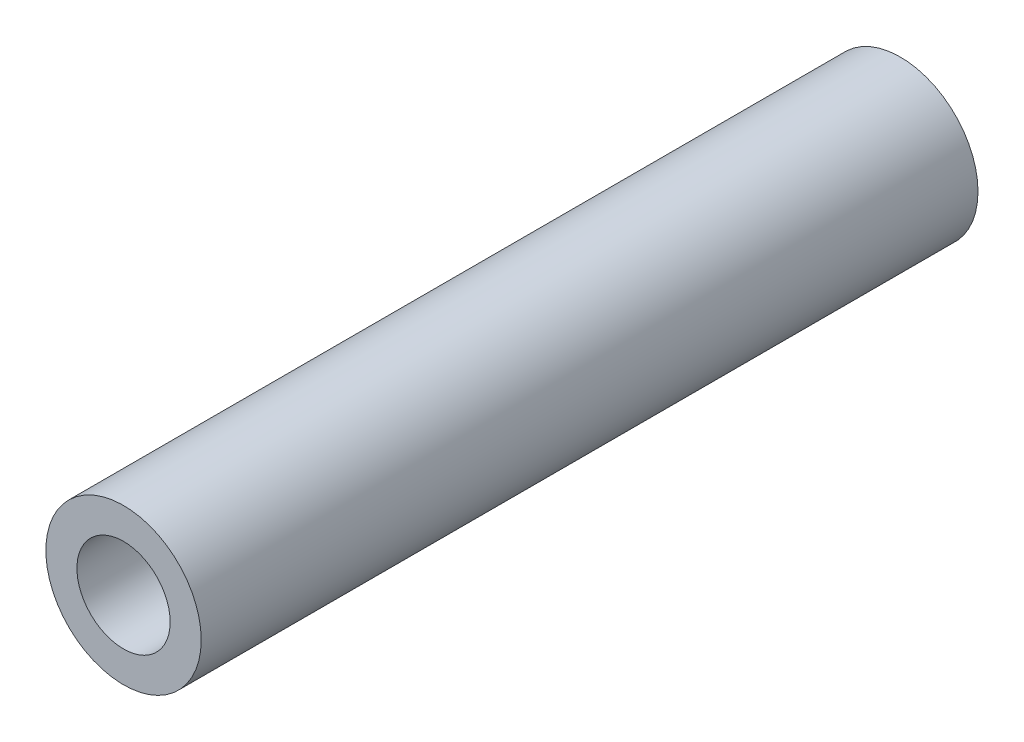
ISO-10303-21;
HEADER;
FILE_DESCRIPTION(('STEP AP214'),'2;1');
FILE_NAME('part.step','',(''),(''),'','','');
FILE_SCHEMA(('AUTOMOTIVE_DESIGN { 1 0 10303 214 1 1 1 1 }'));
ENDSEC;
DATA;
#1=APPLICATION_CONTEXT('core data for automotive mechanical design processes');
#2=APPLICATION_PROTOCOL_DEFINITION('international standard','automotive_design',2000,#1);
#3=PRODUCT_CONTEXT('',#1,'mechanical');
#4=PRODUCT('Part','Part','',(#3));
#5=PRODUCT_RELATED_PRODUCT_CATEGORY('part','',(#4));
#6=PRODUCT_DEFINITION_FORMATION('','',#4);
#7=PRODUCT_DEFINITION_CONTEXT('part definition',#1,'design');
#8=PRODUCT_DEFINITION('design','',#6,#7);
#9=PRODUCT_DEFINITION_SHAPE('','',#8);
#10=(LENGTH_UNIT() NAMED_UNIT(*) SI_UNIT(.MILLI.,.METRE.));
#11=(NAMED_UNIT(*) PLANE_ANGLE_UNIT() SI_UNIT($,.RADIAN.));
#12=(NAMED_UNIT(*) SI_UNIT($,.STERADIAN.) SOLID_ANGLE_UNIT());
#13=UNCERTAINTY_MEASURE_WITH_UNIT(LENGTH_MEASURE(1.E-05),#10,'distance_accuracy_value','');
#14=(GEOMETRIC_REPRESENTATION_CONTEXT(3) GLOBAL_UNCERTAINTY_ASSIGNED_CONTEXT((#13)) GLOBAL_UNIT_ASSIGNED_CONTEXT((#10,
#11,#12)) REPRESENTATION_CONTEXT('',''));
#15=CARTESIAN_POINT('',(0.,0.,0.));
#16=DIRECTION('',(0.,0.,1.));
#17=DIRECTION('',(1.,0.,0.));
#18=AXIS2_PLACEMENT_3D('',#15,#16,#17);
#19=CARTESIAN_POINT('',(0.,0.,12.5));
#20=DIRECTION('',(0.,0.,1.));
#21=DIRECTION('',(1.,0.,0.));
#22=AXIS2_PLACEMENT_3D('',#19,#20,#21);
#23=PLANE('',#22);
#24=CARTESIAN_POINT('',(0.,0.,12.5));
#25=DIRECTION('',(0.,0.,1.));
#26=DIRECTION('',(1.,0.,0.));
#27=AXIS2_PLACEMENT_3D('',#24,#25,#26);
#28=CIRCLE('',#27,2.5);
#29=CARTESIAN_POINT('',(2.5,0.,12.5));
#30=VERTEX_POINT('',#29);
#31=EDGE_CURVE('E10',#30,#30,#28,.T.);
#32=ORIENTED_EDGE('',*,*,#31,.T.);
#33=EDGE_LOOP('',(#32));
#34=FACE_BOUND('',#33,.T.);
#35=CARTESIAN_POINT('',(0.,0.,12.5));
#36=DIRECTION('',(0.,0.,1.));
#37=DIRECTION('',(1.,0.,0.));
#38=AXIS2_PLACEMENT_3D('',#35,#36,#37);
#39=CIRCLE('',#38,1.5);
#40=CARTESIAN_POINT('',(1.5,0.,12.5));
#41=VERTEX_POINT('',#40);
#42=EDGE_CURVE('E41',#41,#41,#39,.T.);
#43=ORIENTED_EDGE('',*,*,#42,.F.);
#44=EDGE_LOOP('',(#43));
#45=FACE_BOUND('',#44,.T.);
#46=ADVANCED_FACE('F30',(#34,#45),#23,.T.);
#47=CARTESIAN_POINT('',(0.,0.,-12.5));
#48=DIRECTION('',(0.,0.,1.));
#49=DIRECTION('',(1.,0.,0.));
#50=AXIS2_PLACEMENT_3D('',#47,#48,#49);
#51=PLANE('',#50);
#52=CARTESIAN_POINT('',(0.,0.,-12.5));
#53=DIRECTION('',(0.,0.,1.));
#54=DIRECTION('',(1.,0.,0.));
#55=AXIS2_PLACEMENT_3D('',#52,#53,#54);
#56=CIRCLE('',#55,2.5);
#57=CARTESIAN_POINT('',(2.5,0.,-12.5));
#58=VERTEX_POINT('',#57);
#59=EDGE_CURVE('E34',#58,#58,#56,.T.);
#60=ORIENTED_EDGE('',*,*,#59,.F.);
#61=EDGE_LOOP('',(#60));
#62=FACE_BOUND('',#61,.T.);
#63=CARTESIAN_POINT('',(0.,0.,-12.5));
#64=DIRECTION('',(0.,0.,1.));
#65=DIRECTION('',(1.,0.,0.));
#66=AXIS2_PLACEMENT_3D('',#63,#64,#65);
#67=CIRCLE('',#66,1.5);
#68=CARTESIAN_POINT('',(1.5,0.,-12.5));
#69=VERTEX_POINT('',#68);
#70=EDGE_CURVE('E43',#69,#69,#67,.T.);
#71=ORIENTED_EDGE('',*,*,#70,.T.);
#72=EDGE_LOOP('',(#71));
#73=FACE_BOUND('',#72,.T.);
#74=ADVANCED_FACE('F53',(#62,#73),#51,.F.);
#75=CARTESIAN_POINT('',(0.,0.,12.5));
#76=DIRECTION('',(0.,0.,-1.));
#77=DIRECTION('',(-1.,0.,0.));
#78=AXIS2_PLACEMENT_3D('',#75,#76,#77);
#79=CYLINDRICAL_SURFACE('',#78,2.5);
#80=ORIENTED_EDGE('',*,*,#31,.F.);
#81=EDGE_LOOP('',(#80));
#82=FACE_BOUND('',#81,.T.);
#83=ORIENTED_EDGE('',*,*,#59,.T.);
#84=EDGE_LOOP('',(#83));
#85=FACE_BOUND('',#84,.T.);
#86=ADVANCED_FACE('F32',(#82,#85),#79,.T.);
#87=CARTESIAN_POINT('',(0.,0.,12.5));
#88=DIRECTION('',(0.,0.,-1.));
#89=DIRECTION('',(-1.,0.,0.));
#90=AXIS2_PLACEMENT_3D('',#87,#88,#89);
#91=CYLINDRICAL_SURFACE('',#90,1.5);
#92=ORIENTED_EDGE('',*,*,#42,.T.);
#93=EDGE_LOOP('',(#92));
#94=FACE_BOUND('',#93,.T.);
#95=ORIENTED_EDGE('',*,*,#70,.F.);
#96=EDGE_LOOP('',(#95));
#97=FACE_BOUND('',#96,.T.);
#98=ADVANCED_FACE('F49',(#94,#97),#91,.F.);
#99=CLOSED_SHELL('',(#46,#74,#86,#98));
#100=MANIFOLD_SOLID_BREP('B2',#99);
#101=ADVANCED_BREP_SHAPE_REPRESENTATION('',(#18,#100),#14);
#102=SHAPE_DEFINITION_REPRESENTATION(#9,#101);
ENDSEC;
END-ISO-10303-21;
